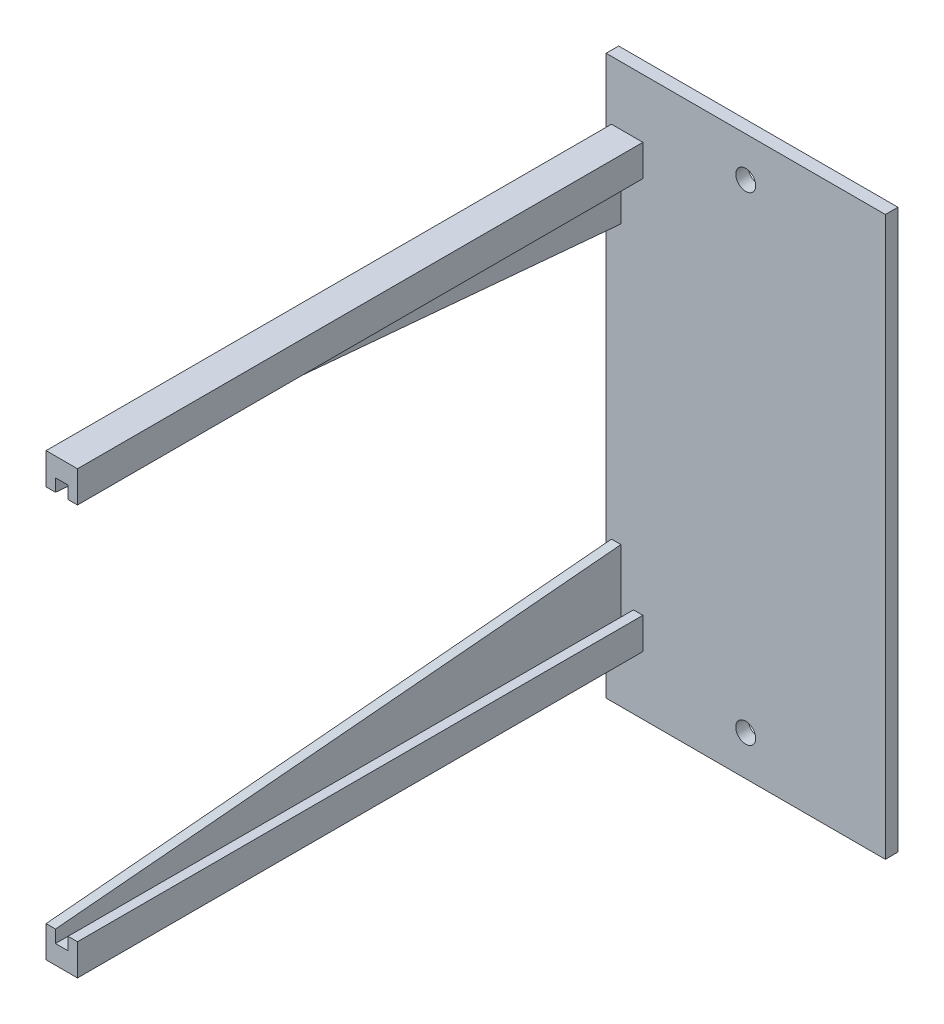
ISO-10303-21;
HEADER;
FILE_DESCRIPTION(('STEP AP214'),'2;1');
FILE_NAME('part.step','',(''),(''),'','','');
FILE_SCHEMA(('AUTOMOTIVE_DESIGN { 1 0 10303 214 1 1 1 1 }'));
ENDSEC;
DATA;
#1=APPLICATION_CONTEXT('core data for automotive mechanical design processes');
#2=APPLICATION_PROTOCOL_DEFINITION('international standard','automotive_design',2000,#1);
#3=PRODUCT_CONTEXT('',#1,'mechanical');
#4=PRODUCT('Part','Part','',(#3));
#5=PRODUCT_RELATED_PRODUCT_CATEGORY('part','',(#4));
#6=PRODUCT_DEFINITION_FORMATION('','',#4);
#7=PRODUCT_DEFINITION_CONTEXT('part definition',#1,'design');
#8=PRODUCT_DEFINITION('design','',#6,#7);
#9=PRODUCT_DEFINITION_SHAPE('','',#8);
#10=(LENGTH_UNIT() NAMED_UNIT(*) SI_UNIT(.MILLI.,.METRE.));
#11=(NAMED_UNIT(*) PLANE_ANGLE_UNIT() SI_UNIT($,.RADIAN.));
#12=(NAMED_UNIT(*) SI_UNIT($,.STERADIAN.) SOLID_ANGLE_UNIT());
#13=UNCERTAINTY_MEASURE_WITH_UNIT(LENGTH_MEASURE(1.E-05),#10,'distance_accuracy_value','');
#14=(GEOMETRIC_REPRESENTATION_CONTEXT(3) GLOBAL_UNCERTAINTY_ASSIGNED_CONTEXT((#13)) GLOBAL_UNIT_ASSIGNED_CONTEXT((#10,
#11,#12)) REPRESENTATION_CONTEXT('',''));
#15=CARTESIAN_POINT('',(0.,0.,0.));
#16=DIRECTION('',(0.,0.,1.));
#17=DIRECTION('',(1.,0.,0.));
#18=AXIS2_PLACEMENT_3D('',#15,#16,#17);
#19=CARTESIAN_POINT('',(-16.3683166717665,-30.1,2.));
#20=DIRECTION('',(0.,-1.,0.));
#21=DIRECTION('',(1.,0.,0.));
#22=AXIS2_PLACEMENT_3D('',#19,#20,#21);
#23=PLANE('',#22);
#24=DIRECTION('',(0.,0.,-1.));
#25=VECTOR('',#24,1.);
#26=CARTESIAN_POINT('',(-17.8683166717665,-30.1,92.));
#27=LINE('',#26,#25);
#28=CARTESIAN_POINT('',(-17.8683166717665,-30.1,92.));
#29=VERTEX_POINT('',#28);
#30=CARTESIAN_POINT('',(-17.8683166717665,-30.1,2.));
#31=VERTEX_POINT('',#30);
#32=EDGE_CURVE('E226',#29,#31,#27,.T.);
#33=ORIENTED_EDGE('',*,*,#32,.F.);
#34=DIRECTION('',(-1.,0.,0.));
#35=VECTOR('',#34,1.);
#36=CARTESIAN_POINT('',(-16.3683166717665,-30.1,92.));
#37=LINE('',#36,#35);
#38=CARTESIAN_POINT('',(-16.3683166717665,-30.1,92.));
#39=VERTEX_POINT('',#38);
#40=EDGE_CURVE('E260',#39,#29,#37,.T.);
#41=ORIENTED_EDGE('',*,*,#40,.F.);
#42=DIRECTION('',(0.,0.,1.));
#43=VECTOR('',#42,1.);
#44=CARTESIAN_POINT('',(-16.3683166717665,-30.1,2.));
#45=LINE('',#44,#43);
#46=CARTESIAN_POINT('',(-16.3683166717665,-30.1,2.));
#47=VERTEX_POINT('',#46);
#48=EDGE_CURVE('E248',#47,#39,#45,.T.);
#49=ORIENTED_EDGE('',*,*,#48,.F.);
#50=DIRECTION('',(-1.,0.,0.));
#51=VECTOR('',#50,1.);
#52=CARTESIAN_POINT('',(-16.3683166717665,-30.1,2.));
#53=LINE('',#52,#51);
#54=EDGE_CURVE('E257',#47,#31,#53,.T.);
#55=ORIENTED_EDGE('',*,*,#54,.T.);
#56=EDGE_LOOP('',(#33,#41,#49,#55));
#57=FACE_BOUND('',#56,.T.);
#58=ADVANCED_FACE('F65',(#57),#23,.F.);
#59=CARTESIAN_POINT('',(0.,0.,2.));
#60=DIRECTION('',(0.,0.,1.));
#61=DIRECTION('',(1.,0.,0.));
#62=AXIS2_PLACEMENT_3D('',#59,#60,#61);
#63=PLANE('',#62);
#64=DIRECTION('',(0.,1.,0.));
#65=VECTOR('',#64,1.);
#66=CARTESIAN_POINT('',(-21.3683166717665,-35.1,2.));
#67=LINE('',#66,#65);
#68=CARTESIAN_POINT('',(-21.3683166717665,-35.1,2.));
#69=VERTEX_POINT('',#68);
#70=CARTESIAN_POINT('',(-21.3683166717665,-22.1000000000848,2.));
#71=VERTEX_POINT('',#70);
#72=EDGE_CURVE('E80',#69,#71,#67,.T.);
#73=ORIENTED_EDGE('',*,*,#72,.T.);
#74=DIRECTION('',(1.,0.,0.));
#75=VECTOR('',#74,1.);
#76=CARTESIAN_POINT('',(-111.723172656276,-22.1000000000799,2.00000000002535));
#77=LINE('',#76,#75);
#78=CARTESIAN_POINT('',(-19.8683166717665,-22.1000000000848,2.));
#79=VERTEX_POINT('',#78);
#80=EDGE_CURVE('E657',#71,#79,#77,.T.);
#81=ORIENTED_EDGE('',*,*,#80,.T.);
#82=DIRECTION('',(0.,1.,0.));
#83=VECTOR('',#82,1.);
#84=CARTESIAN_POINT('',(-19.8683166717665,-32.1,2.));
#85=LINE('',#84,#83);
#86=CARTESIAN_POINT('',(-19.8683166717665,-32.1,2.));
#87=VERTEX_POINT('',#86);
#88=EDGE_CURVE('E88',#87,#79,#85,.T.);
#89=ORIENTED_EDGE('',*,*,#88,.F.);
#90=DIRECTION('',(1.,0.,0.));
#91=VECTOR('',#90,1.);
#92=CARTESIAN_POINT('',(-19.8683166717665,-32.1,2.));
#93=LINE('',#92,#91);
#94=CARTESIAN_POINT('',(-17.8683166717665,-32.1,2.));
#95=VERTEX_POINT('',#94);
#96=EDGE_CURVE('E210',#87,#95,#93,.T.);
#97=ORIENTED_EDGE('',*,*,#96,.T.);
#98=DIRECTION('',(0.,1.,0.));
#99=VECTOR('',#98,1.);
#100=CARTESIAN_POINT('',(-17.8683166717665,-32.1,2.));
#101=LINE('',#100,#99);
#102=EDGE_CURVE('E220',#95,#31,#101,.T.);
#103=ORIENTED_EDGE('',*,*,#102,.T.);
#104=ORIENTED_EDGE('',*,*,#54,.F.);
#105=DIRECTION('',(0.,1.,0.));
#106=VECTOR('',#105,1.);
#107=CARTESIAN_POINT('',(-16.3683166717665,-35.1,2.));
#108=LINE('',#107,#106);
#109=CARTESIAN_POINT('',(-16.3683166717665,-35.1,2.));
#110=VERTEX_POINT('',#109);
#111=EDGE_CURVE('E250',#110,#47,#108,.T.);
#112=ORIENTED_EDGE('',*,*,#111,.F.);
#113=DIRECTION('',(-1.,0.,0.));
#114=VECTOR('',#113,1.);
#115=CARTESIAN_POINT('',(-16.3683166717665,-35.1,2.));
#116=LINE('',#115,#114);
#117=EDGE_CURVE('E254',#110,#69,#116,.T.);
#118=ORIENTED_EDGE('',*,*,#117,.T.);
#119=EDGE_LOOP('',(#73,#81,#89,#97,#103,#104,#112,#118));
#120=FACE_BOUND('',#119,.T.);
#121=CARTESIAN_POINT('',(0.,38.1,2.));
#122=DIRECTION('',(0.,0.,1.));
#123=DIRECTION('',(1.,0.,0.));
#124=AXIS2_PLACEMENT_3D('',#121,#122,#123);
#125=CIRCLE('',#124,1.5875);
#126=CARTESIAN_POINT('',(1.58750000000001,38.1,2.));
#127=VERTEX_POINT('',#126);
#128=EDGE_CURVE('E332',#127,#127,#125,.T.);
#129=ORIENTED_EDGE('',*,*,#128,.F.);
#130=EDGE_LOOP('',(#129));
#131=FACE_BOUND('',#130,.T.);
#132=DIRECTION('',(0.,-1.,0.));
#133=VECTOR('',#132,1.);
#134=CARTESIAN_POINT('',(-22.225,44.45,2.));
#135=LINE('',#134,#133);
#136=CARTESIAN_POINT('',(-22.225,44.45,2.));
#137=VERTEX_POINT('',#136);
#138=CARTESIAN_POINT('',(-22.225,-44.45,2.));
#139=VERTEX_POINT('',#138);
#140=EDGE_CURVE('E338',#137,#139,#135,.T.);
#141=ORIENTED_EDGE('',*,*,#140,.T.);
#142=DIRECTION('',(1.,0.,0.));
#143=VECTOR('',#142,1.);
#144=CARTESIAN_POINT('',(-22.225,-44.45,2.));
#145=LINE('',#144,#143);
#146=CARTESIAN_POINT('',(22.225,-44.45,2.));
#147=VERTEX_POINT('',#146);
#148=EDGE_CURVE('E341',#139,#147,#145,.T.);
#149=ORIENTED_EDGE('',*,*,#148,.T.);
#150=DIRECTION('',(0.,-1.,0.));
#151=VECTOR('',#150,1.);
#152=CARTESIAN_POINT('',(22.225,44.45,2.));
#153=LINE('',#152,#151);
#154=CARTESIAN_POINT('',(22.225,44.45,2.));
#155=VERTEX_POINT('',#154);
#156=EDGE_CURVE('E344',#155,#147,#153,.T.);
#157=ORIENTED_EDGE('',*,*,#156,.F.);
#158=DIRECTION('',(1.,0.,0.));
#159=VECTOR('',#158,1.);
#160=CARTESIAN_POINT('',(-22.225,44.45,2.));
#161=LINE('',#160,#159);
#162=EDGE_CURVE('E347',#137,#155,#161,.T.);
#163=ORIENTED_EDGE('',*,*,#162,.F.);
#164=EDGE_LOOP('',(#141,#149,#157,#163));
#165=FACE_BOUND('',#164,.T.);
#166=CARTESIAN_POINT('',(0.,-38.1,2.));
#167=DIRECTION('',(0.,0.,1.));
#168=DIRECTION('',(1.,0.,0.));
#169=AXIS2_PLACEMENT_3D('',#166,#167,#168);
#170=CIRCLE('',#169,1.5875);
#171=CARTESIAN_POINT('',(1.58750000000001,-38.1,2.));
#172=VERTEX_POINT('',#171);
#173=EDGE_CURVE('E326',#172,#172,#170,.T.);
#174=ORIENTED_EDGE('',*,*,#173,.F.);
#175=EDGE_LOOP('',(#174));
#176=FACE_BOUND('',#175,.T.);
#177=DIRECTION('',(0.,-1.,0.));
#178=VECTOR('',#177,1.);
#179=CARTESIAN_POINT('',(-19.8683166717665,32.1,2.));
#180=LINE('',#179,#178);
#181=CARTESIAN_POINT('',(-19.8683166717665,32.1,2.));
#182=VERTEX_POINT('',#181);
#183=CARTESIAN_POINT('',(-19.8683166717665,22.1000000000231,1.99999999999374));
#184=VERTEX_POINT('',#183);
#185=EDGE_CURVE('E269',#182,#184,#180,.T.);
#186=ORIENTED_EDGE('',*,*,#185,.T.);
#187=DIRECTION('',(1.,0.,0.));
#188=VECTOR('',#187,1.);
#189=CARTESIAN_POINT('',(-111.723172656256,22.1000000000231,1.99999999999374));
#190=LINE('',#189,#188);
#191=CARTESIAN_POINT('',(-21.3683166717665,22.1000000000231,1.99999999999374));
#192=VERTEX_POINT('',#191);
#193=EDGE_CURVE('E256',#192,#184,#190,.T.);
#194=ORIENTED_EDGE('',*,*,#193,.F.);
#195=DIRECTION('',(0.,-1.,0.));
#196=VECTOR('',#195,1.);
#197=CARTESIAN_POINT('',(-21.3683166717665,35.1,2.));
#198=LINE('',#197,#196);
#199=CARTESIAN_POINT('',(-21.3683166717665,35.1,2.));
#200=VERTEX_POINT('',#199);
#201=EDGE_CURVE('E297',#200,#192,#198,.T.);
#202=ORIENTED_EDGE('',*,*,#201,.F.);
#203=DIRECTION('',(-1.,0.,0.));
#204=VECTOR('',#203,1.);
#205=CARTESIAN_POINT('',(-16.3683166717665,35.1,2.));
#206=LINE('',#205,#204);
#207=CARTESIAN_POINT('',(-16.3683166717665,35.1,2.));
#208=VERTEX_POINT('',#207);
#209=EDGE_CURVE('E313',#208,#200,#206,.T.);
#210=ORIENTED_EDGE('',*,*,#209,.F.);
#211=DIRECTION('',(0.,-1.,0.));
#212=VECTOR('',#211,1.);
#213=CARTESIAN_POINT('',(-16.3683166717665,35.1,2.));
#214=LINE('',#213,#212);
#215=CARTESIAN_POINT('',(-16.3683166717665,30.1,2.));
#216=VERTEX_POINT('',#215);
#217=EDGE_CURVE('E305',#208,#216,#214,.T.);
#218=ORIENTED_EDGE('',*,*,#217,.T.);
#219=DIRECTION('',(-1.,0.,0.));
#220=VECTOR('',#219,1.);
#221=CARTESIAN_POINT('',(-16.3683166717665,30.1,2.));
#222=LINE('',#221,#220);
#223=CARTESIAN_POINT('',(-17.8683166717665,30.1,2.));
#224=VERTEX_POINT('',#223);
#225=EDGE_CURVE('E321',#216,#224,#222,.T.);
#226=ORIENTED_EDGE('',*,*,#225,.T.);
#227=DIRECTION('',(0.,-1.,0.));
#228=VECTOR('',#227,1.);
#229=CARTESIAN_POINT('',(-17.8683166717665,32.1,2.));
#230=LINE('',#229,#228);
#231=CARTESIAN_POINT('',(-17.8683166717665,32.1,2.));
#232=VERTEX_POINT('',#231);
#233=EDGE_CURVE('E284',#232,#224,#230,.T.);
#234=ORIENTED_EDGE('',*,*,#233,.F.);
#235=DIRECTION('',(1.,0.,0.));
#236=VECTOR('',#235,1.);
#237=CARTESIAN_POINT('',(-19.8683166717665,32.1,2.));
#238=LINE('',#237,#236);
#239=EDGE_CURVE('E276',#182,#232,#238,.T.);
#240=ORIENTED_EDGE('',*,*,#239,.F.);
#241=EDGE_LOOP('',(#186,#194,#202,#210,#218,#226,#234,#240));
#242=FACE_BOUND('',#241,.T.);
#243=ADVANCED_FACE('F381',(#120,#131,#165,#176,#242),#63,.T.);
#244=CARTESIAN_POINT('',(-16.3683166717665,30.1,92.));
#245=DIRECTION('',(0.,0.,1.));
#246=DIRECTION('',(1.,0.,0.));
#247=AXIS2_PLACEMENT_3D('',#244,#245,#246);
#248=PLANE('',#247);
#249=DIRECTION('',(-1.,0.,0.));
#250=VECTOR('',#249,1.);
#251=CARTESIAN_POINT('',(-16.3683166717665,30.1,92.));
#252=LINE('',#251,#250);
#253=CARTESIAN_POINT('',(-19.8683166717665,30.100000000015,91.9999999998709));
#254=VERTEX_POINT('',#253);
#255=CARTESIAN_POINT('',(-21.3683166717665,30.100000000015,91.9999999998709));
#256=VERTEX_POINT('',#255);
#257=EDGE_CURVE('E320',#254,#256,#252,.T.);
#258=ORIENTED_EDGE('',*,*,#257,.F.);
#259=DIRECTION('',(0.,-1.,0.));
#260=VECTOR('',#259,1.);
#261=CARTESIAN_POINT('',(-19.8683166717665,32.1,92.));
#262=LINE('',#261,#260);
#263=CARTESIAN_POINT('',(-19.8683166717665,32.1,92.));
#264=VERTEX_POINT('',#263);
#265=EDGE_CURVE('E272',#264,#254,#262,.T.);
#266=ORIENTED_EDGE('',*,*,#265,.F.);
#267=DIRECTION('',(1.,0.,0.));
#268=VECTOR('',#267,1.);
#269=CARTESIAN_POINT('',(-19.8683166717665,32.1,92.));
#270=LINE('',#269,#268);
#271=CARTESIAN_POINT('',(-17.8683166717665,32.1,92.));
#272=VERTEX_POINT('',#271);
#273=EDGE_CURVE('E279',#264,#272,#270,.T.);
#274=ORIENTED_EDGE('',*,*,#273,.T.);
#275=DIRECTION('',(0.,-1.,0.));
#276=VECTOR('',#275,1.);
#277=CARTESIAN_POINT('',(-17.8683166717665,32.1,92.));
#278=LINE('',#277,#276);
#279=CARTESIAN_POINT('',(-17.8683166717665,30.1,92.));
#280=VERTEX_POINT('',#279);
#281=EDGE_CURVE('E275',#272,#280,#278,.T.);
#282=ORIENTED_EDGE('',*,*,#281,.T.);
#283=CARTESIAN_POINT('',(-16.3683166717665,30.1,92.));
#284=VERTEX_POINT('',#283);
#285=EDGE_CURVE('E317',#284,#280,#252,.T.);
#286=ORIENTED_EDGE('',*,*,#285,.F.);
#287=DIRECTION('',(0.,1.,0.));
#288=VECTOR('',#287,1.);
#289=CARTESIAN_POINT('',(-16.3683166717665,30.1,92.));
#290=LINE('',#289,#288);
#291=CARTESIAN_POINT('',(-16.3683166717665,35.1,92.));
#292=VERTEX_POINT('',#291);
#293=EDGE_CURVE('E310',#284,#292,#290,.T.);
#294=ORIENTED_EDGE('',*,*,#293,.T.);
#295=DIRECTION('',(-1.,0.,0.));
#296=VECTOR('',#295,1.);
#297=CARTESIAN_POINT('',(-16.3683166717665,35.1,92.));
#298=LINE('',#297,#296);
#299=CARTESIAN_POINT('',(-21.3683166717665,35.1,92.));
#300=VERTEX_POINT('',#299);
#301=EDGE_CURVE('E314',#292,#300,#298,.T.);
#302=ORIENTED_EDGE('',*,*,#301,.T.);
#303=DIRECTION('',(0.,1.,0.));
#304=VECTOR('',#303,1.);
#305=CARTESIAN_POINT('',(-21.3683166717665,30.1,92.));
#306=LINE('',#305,#304);
#307=EDGE_CURVE('E299',#256,#300,#306,.T.);
#308=ORIENTED_EDGE('',*,*,#307,.F.);
#309=EDGE_LOOP('',(#258,#266,#274,#282,#286,#294,#302,#308));
#310=FACE_BOUND('',#309,.T.);
#311=ADVANCED_FACE('F389',(#310),#248,.T.);
#312=CARTESIAN_POINT('',(0.,0.,0.));
#313=DIRECTION('',(0.,0.,1.));
#314=DIRECTION('',(1.,0.,0.));
#315=AXIS2_PLACEMENT_3D('',#312,#313,#314);
#316=PLANE('',#315);
#317=CARTESIAN_POINT('',(0.,38.1,0.));
#318=DIRECTION('',(0.,0.,1.));
#319=DIRECTION('',(1.,0.,0.));
#320=AXIS2_PLACEMENT_3D('',#317,#318,#319);
#321=CIRCLE('',#320,1.5875);
#322=CARTESIAN_POINT('',(1.58750000000001,38.1,0.));
#323=VERTEX_POINT('',#322);
#324=EDGE_CURVE('E329',#323,#323,#321,.T.);
#325=ORIENTED_EDGE('',*,*,#324,.T.);
#326=EDGE_LOOP('',(#325));
#327=FACE_BOUND('',#326,.T.);
#328=DIRECTION('',(0.,-1.,0.));
#329=VECTOR('',#328,1.);
#330=CARTESIAN_POINT('',(-22.225,44.45,0.));
#331=LINE('',#330,#329);
#332=CARTESIAN_POINT('',(-22.225,44.45,0.));
#333=VERTEX_POINT('',#332);
#334=CARTESIAN_POINT('',(-22.225,-44.45,0.));
#335=VERTEX_POINT('',#334);
#336=EDGE_CURVE('E335',#333,#335,#331,.T.);
#337=ORIENTED_EDGE('',*,*,#336,.F.);
#338=DIRECTION('',(1.,0.,0.));
#339=VECTOR('',#338,1.);
#340=CARTESIAN_POINT('',(-22.225,44.45,0.));
#341=LINE('',#340,#339);
#342=CARTESIAN_POINT('',(22.225,44.45,0.));
#343=VERTEX_POINT('',#342);
#344=EDGE_CURVE('E342',#333,#343,#341,.T.);
#345=ORIENTED_EDGE('',*,*,#344,.T.);
#346=DIRECTION('',(0.,-1.,0.));
#347=VECTOR('',#346,1.);
#348=CARTESIAN_POINT('',(22.225,44.45,0.));
#349=LINE('',#348,#347);
#350=CARTESIAN_POINT('',(22.225,-44.45,0.));
#351=VERTEX_POINT('',#350);
#352=EDGE_CURVE('E356',#343,#351,#349,.T.);
#353=ORIENTED_EDGE('',*,*,#352,.T.);
#354=DIRECTION('',(1.,0.,0.));
#355=VECTOR('',#354,1.);
#356=CARTESIAN_POINT('',(-22.225,-44.45,0.));
#357=LINE('',#356,#355);
#358=EDGE_CURVE('E353',#335,#351,#357,.T.);
#359=ORIENTED_EDGE('',*,*,#358,.F.);
#360=EDGE_LOOP('',(#337,#345,#353,#359));
#361=FACE_BOUND('',#360,.T.);
#362=CARTESIAN_POINT('',(0.,-38.1,0.));
#363=DIRECTION('',(0.,0.,1.));
#364=DIRECTION('',(1.,0.,0.));
#365=AXIS2_PLACEMENT_3D('',#362,#363,#364);
#366=CIRCLE('',#365,1.5875);
#367=CARTESIAN_POINT('',(1.58750000000001,-38.1,0.));
#368=VERTEX_POINT('',#367);
#369=EDGE_CURVE('E316',#368,#368,#366,.T.);
#370=ORIENTED_EDGE('',*,*,#369,.T.);
#371=EDGE_LOOP('',(#370));
#372=FACE_BOUND('',#371,.T.);
#373=ADVANCED_FACE('F373',(#327,#361,#372),#316,.F.);
#374=CARTESIAN_POINT('',(-22.225,44.45,2.));
#375=DIRECTION('',(1.,0.,0.));
#376=DIRECTION('',(0.,0.,-1.));
#377=AXIS2_PLACEMENT_3D('',#374,#375,#376);
#378=PLANE('',#377);
#379=ORIENTED_EDGE('',*,*,#336,.T.);
#380=DIRECTION('',(0.,0.,-1.));
#381=VECTOR('',#380,1.);
#382=CARTESIAN_POINT('',(-22.225,-44.45,2.));
#383=LINE('',#382,#381);
#384=EDGE_CURVE('E12',#139,#335,#383,.T.);
#385=ORIENTED_EDGE('',*,*,#384,.F.);
#386=ORIENTED_EDGE('',*,*,#140,.F.);
#387=DIRECTION('',(0.,0.,-1.));
#388=VECTOR('',#387,1.);
#389=CARTESIAN_POINT('',(-22.225,44.45,2.));
#390=LINE('',#389,#388);
#391=EDGE_CURVE('E350',#137,#333,#390,.T.);
#392=ORIENTED_EDGE('',*,*,#391,.T.);
#393=EDGE_LOOP('',(#379,#385,#386,#392));
#394=FACE_BOUND('',#393,.T.);
#395=ADVANCED_FACE('F67',(#394),#378,.F.);
#396=CARTESIAN_POINT('',(-22.225,-44.45,2.));
#397=DIRECTION('',(0.,1.,0.));
#398=DIRECTION('',(0.,0.,1.));
#399=AXIS2_PLACEMENT_3D('',#396,#397,#398);
#400=PLANE('',#399);
#401=ORIENTED_EDGE('',*,*,#358,.T.);
#402=DIRECTION('',(0.,0.,-1.));
#403=VECTOR('',#402,1.);
#404=CARTESIAN_POINT('',(22.225,-44.45,2.));
#405=LINE('',#404,#403);
#406=EDGE_CURVE('E73',#147,#351,#405,.T.);
#407=ORIENTED_EDGE('',*,*,#406,.F.);
#408=ORIENTED_EDGE('',*,*,#148,.F.);
#409=ORIENTED_EDGE('',*,*,#384,.T.);
#410=EDGE_LOOP('',(#401,#407,#408,#409));
#411=FACE_BOUND('',#410,.T.);
#412=ADVANCED_FACE('F369',(#411),#400,.F.);
#413=CARTESIAN_POINT('',(22.225,44.45,2.));
#414=DIRECTION('',(1.,0.,0.));
#415=DIRECTION('',(0.,0.,-1.));
#416=AXIS2_PLACEMENT_3D('',#413,#414,#415);
#417=PLANE('',#416);
#418=ORIENTED_EDGE('',*,*,#352,.F.);
#419=DIRECTION('',(0.,0.,-1.));
#420=VECTOR('',#419,1.);
#421=CARTESIAN_POINT('',(22.225,44.45,2.));
#422=LINE('',#421,#420);
#423=EDGE_CURVE('E362',#155,#343,#422,.T.);
#424=ORIENTED_EDGE('',*,*,#423,.F.);
#425=ORIENTED_EDGE('',*,*,#156,.T.);
#426=ORIENTED_EDGE('',*,*,#406,.T.);
#427=EDGE_LOOP('',(#418,#424,#425,#426));
#428=FACE_BOUND('',#427,.T.);
#429=ADVANCED_FACE('F366',(#428),#417,.T.);
#430=CARTESIAN_POINT('',(-22.225,44.45,2.));
#431=DIRECTION('',(0.,1.,0.));
#432=DIRECTION('',(0.,0.,1.));
#433=AXIS2_PLACEMENT_3D('',#430,#431,#432);
#434=PLANE('',#433);
#435=ORIENTED_EDGE('',*,*,#344,.F.);
#436=ORIENTED_EDGE('',*,*,#391,.F.);
#437=ORIENTED_EDGE('',*,*,#162,.T.);
#438=ORIENTED_EDGE('',*,*,#423,.T.);
#439=EDGE_LOOP('',(#435,#436,#437,#438));
#440=FACE_BOUND('',#439,.T.);
#441=ADVANCED_FACE('F377',(#440),#434,.T.);
#442=CARTESIAN_POINT('',(0.,38.1,2.));
#443=DIRECTION('',(0.,0.,-1.));
#444=DIRECTION('',(-1.,0.,0.));
#445=AXIS2_PLACEMENT_3D('',#442,#443,#444);
#446=CYLINDRICAL_SURFACE('',#445,1.5875);
#447=ORIENTED_EDGE('',*,*,#128,.T.);
#448=EDGE_LOOP('',(#447));
#449=FACE_BOUND('',#448,.T.);
#450=ORIENTED_EDGE('',*,*,#324,.F.);
#451=EDGE_LOOP('',(#450));
#452=FACE_BOUND('',#451,.T.);
#453=ADVANCED_FACE('F448',(#449,#452),#446,.F.);
#454=CARTESIAN_POINT('',(0.,-38.1,2.));
#455=DIRECTION('',(0.,0.,-1.));
#456=DIRECTION('',(-1.,0.,0.));
#457=AXIS2_PLACEMENT_3D('',#454,#455,#456);
#458=CYLINDRICAL_SURFACE('',#457,1.5875);
#459=ORIENTED_EDGE('',*,*,#173,.T.);
#460=EDGE_LOOP('',(#459));
#461=FACE_BOUND('',#460,.T.);
#462=ORIENTED_EDGE('',*,*,#369,.F.);
#463=EDGE_LOOP('',(#462));
#464=FACE_BOUND('',#463,.T.);
#465=ADVANCED_FACE('F444',(#461,#464),#458,.F.);
#466=CARTESIAN_POINT('',(-16.3683166717665,35.1,92.));
#467=DIRECTION('',(0.,1.,0.));
#468=DIRECTION('',(-1.,0.,0.));
#469=AXIS2_PLACEMENT_3D('',#466,#467,#468);
#470=PLANE('',#469);
#471=ORIENTED_EDGE('',*,*,#209,.T.);
#472=DIRECTION('',(0.,0.,-1.));
#473=VECTOR('',#472,1.);
#474=CARTESIAN_POINT('',(-21.3683166717665,35.1,92.));
#475=LINE('',#474,#473);
#476=EDGE_CURVE('E294',#300,#200,#475,.T.);
#477=ORIENTED_EDGE('',*,*,#476,.F.);
#478=ORIENTED_EDGE('',*,*,#301,.F.);
#479=DIRECTION('',(0.,0.,-1.));
#480=VECTOR('',#479,1.);
#481=CARTESIAN_POINT('',(-16.3683166717665,35.1,92.));
#482=LINE('',#481,#480);
#483=EDGE_CURVE('E302',#292,#208,#482,.T.);
#484=ORIENTED_EDGE('',*,*,#483,.T.);
#485=EDGE_LOOP('',(#471,#477,#478,#484));
#486=FACE_BOUND('',#485,.T.);
#487=ADVANCED_FACE('F440',(#486),#470,.T.);
#488=CARTESIAN_POINT('',(-16.3683166717665,30.1,2.));
#489=DIRECTION('',(0.,-1.,0.));
#490=DIRECTION('',(1.,0.,0.));
#491=AXIS2_PLACEMENT_3D('',#488,#489,#490);
#492=PLANE('',#491);
#493=DIRECTION('',(0.,0.,-1.));
#494=VECTOR('',#493,1.);
#495=CARTESIAN_POINT('',(-17.8683166717665,30.1,92.));
#496=LINE('',#495,#494);
#497=EDGE_CURVE('E291',#280,#224,#496,.T.);
#498=ORIENTED_EDGE('',*,*,#497,.T.);
#499=ORIENTED_EDGE('',*,*,#225,.F.);
#500=DIRECTION('',(0.,0.,1.));
#501=VECTOR('',#500,1.);
#502=CARTESIAN_POINT('',(-16.3683166717665,30.1,2.));
#503=LINE('',#502,#501);
#504=EDGE_CURVE('E307',#216,#284,#503,.T.);
#505=ORIENTED_EDGE('',*,*,#504,.T.);
#506=ORIENTED_EDGE('',*,*,#285,.T.);
#507=EDGE_LOOP('',(#498,#499,#505,#506));
#508=FACE_BOUND('',#507,.T.);
#509=ADVANCED_FACE('F433',(#508),#492,.T.);
#510=CARTESIAN_POINT('',(-16.3683166717665,0.,0.));
#511=DIRECTION('',(-1.,0.,0.));
#512=DIRECTION('',(0.,0.,1.));
#513=AXIS2_PLACEMENT_3D('',#510,#511,#512);
#514=PLANE('',#513);
#515=ORIENTED_EDGE('',*,*,#483,.F.);
#516=ORIENTED_EDGE('',*,*,#293,.F.);
#517=ORIENTED_EDGE('',*,*,#504,.F.);
#518=ORIENTED_EDGE('',*,*,#217,.F.);
#519=EDGE_LOOP('',(#515,#516,#517,#518));
#520=FACE_BOUND('',#519,.T.);
#521=ADVANCED_FACE('F429',(#520),#514,.F.);
#522=CARTESIAN_POINT('',(-21.3683166717665,0.,0.));
#523=DIRECTION('',(-1.,0.,0.));
#524=DIRECTION('',(0.,0.,1.));
#525=AXIS2_PLACEMENT_3D('',#522,#523,#524);
#526=PLANE('',#525);
#527=ORIENTED_EDGE('',*,*,#476,.T.);
#528=ORIENTED_EDGE('',*,*,#201,.T.);
#529=DIRECTION('',(0.,0.0885397902837945,0.996072640692687));
#530=VECTOR('',#529,1.);
#531=CARTESIAN_POINT('',(-21.3683166717665,33017.0416952475,371195.094071534));
#532=LINE('',#531,#530);
#533=EDGE_CURVE('E266',#192,#256,#532,.T.);
#534=ORIENTED_EDGE('',*,*,#533,.T.);
#535=ORIENTED_EDGE('',*,*,#307,.T.);
#536=EDGE_LOOP('',(#527,#528,#534,#535));
#537=FACE_BOUND('',#536,.T.);
#538=ADVANCED_FACE('F425',(#537),#526,.T.);
#539=CARTESIAN_POINT('',(-19.8683166717665,32.1,92.));
#540=DIRECTION('',(1.,0.,0.));
#541=DIRECTION('',(0.,0.,-1.));
#542=AXIS2_PLACEMENT_3D('',#539,#540,#541);
#543=PLANE('',#542);
#544=ORIENTED_EDGE('',*,*,#185,.F.);
#545=DIRECTION('',(0.,0.,-1.));
#546=VECTOR('',#545,1.);
#547=CARTESIAN_POINT('',(-19.8683166717665,32.1,92.));
#548=LINE('',#547,#546);
#549=EDGE_CURVE('E282',#264,#182,#548,.T.);
#550=ORIENTED_EDGE('',*,*,#549,.F.);
#551=ORIENTED_EDGE('',*,*,#265,.T.);
#552=DIRECTION('',(0.,0.0885397902837945,0.996072640692687));
#553=VECTOR('',#552,1.);
#554=CARTESIAN_POINT('',(-19.8683166717665,33017.0416952475,371195.094071534));
#555=LINE('',#554,#553);
#556=EDGE_CURVE('E264',#184,#254,#555,.T.);
#557=ORIENTED_EDGE('',*,*,#556,.F.);
#558=EDGE_LOOP('',(#544,#550,#551,#557));
#559=FACE_BOUND('',#558,.T.);
#560=ADVANCED_FACE('F421',(#559),#543,.T.);
#561=CARTESIAN_POINT('',(-17.8683166717665,32.1,92.));
#562=DIRECTION('',(1.,0.,0.));
#563=DIRECTION('',(0.,1.,0.));
#564=AXIS2_PLACEMENT_3D('',#561,#562,#563);
#565=PLANE('',#564);
#566=ORIENTED_EDGE('',*,*,#233,.T.);
#567=ORIENTED_EDGE('',*,*,#497,.F.);
#568=ORIENTED_EDGE('',*,*,#281,.F.);
#569=DIRECTION('',(0.,0.,-1.));
#570=VECTOR('',#569,1.);
#571=CARTESIAN_POINT('',(-17.8683166717665,32.1,92.));
#572=LINE('',#571,#570);
#573=EDGE_CURVE('E289',#272,#232,#572,.T.);
#574=ORIENTED_EDGE('',*,*,#573,.T.);
#575=EDGE_LOOP('',(#566,#567,#568,#574));
#576=FACE_BOUND('',#575,.T.);
#577=ADVANCED_FACE('F417',(#576),#565,.F.);
#578=CARTESIAN_POINT('',(-19.8683166717665,32.1,92.));
#579=DIRECTION('',(0.,1.,0.));
#580=DIRECTION('',(0.,0.,1.));
#581=AXIS2_PLACEMENT_3D('',#578,#579,#580);
#582=PLANE('',#581);
#583=ORIENTED_EDGE('',*,*,#239,.T.);
#584=ORIENTED_EDGE('',*,*,#573,.F.);
#585=ORIENTED_EDGE('',*,*,#273,.F.);
#586=ORIENTED_EDGE('',*,*,#549,.T.);
#587=EDGE_LOOP('',(#583,#584,#585,#586));
#588=FACE_BOUND('',#587,.T.);
#589=ADVANCED_FACE('F413',(#588),#582,.F.);
#590=CARTESIAN_POINT('',(-111.723172656256,33017.0416952475,371195.094071534));
#591=DIRECTION('',(0.,0.996072640692686,-0.0885397902837945));
#592=DIRECTION('',(0.,0.0885397902837945,0.996072640692687));
#593=AXIS2_PLACEMENT_3D('',#590,#591,#592);
#594=PLANE('',#593);
#595=ORIENTED_EDGE('',*,*,#533,.F.);
#596=ORIENTED_EDGE('',*,*,#193,.T.);
#597=ORIENTED_EDGE('',*,*,#556,.T.);
#598=ORIENTED_EDGE('',*,*,#257,.T.);
#599=EDGE_LOOP('',(#595,#596,#597,#598));
#600=FACE_BOUND('',#599,.T.);
#601=ADVANCED_FACE('F409',(#600),#594,.F.);
#602=CARTESIAN_POINT('',(-16.3683166717665,-35.1,92.));
#603=DIRECTION('',(0.,1.,0.));
#604=DIRECTION('',(-1.,0.,0.));
#605=AXIS2_PLACEMENT_3D('',#602,#603,#604);
#606=PLANE('',#605);
#607=DIRECTION('',(-1.,0.,0.));
#608=VECTOR('',#607,1.);
#609=CARTESIAN_POINT('',(-16.3683166717665,-35.1,92.));
#610=LINE('',#609,#608);
#611=CARTESIAN_POINT('',(-16.3683166717665,-35.1,92.));
#612=VERTEX_POINT('',#611);
#613=CARTESIAN_POINT('',(-21.3683166717665,-35.1,92.));
#614=VERTEX_POINT('',#613);
#615=EDGE_CURVE('E253',#612,#614,#610,.T.);
#616=ORIENTED_EDGE('',*,*,#615,.T.);
#617=DIRECTION('',(0.,0.,-1.));
#618=VECTOR('',#617,1.);
#619=CARTESIAN_POINT('',(-21.3683166717665,-35.1,92.));
#620=LINE('',#619,#618);
#621=EDGE_CURVE('E211',#614,#69,#620,.T.);
#622=ORIENTED_EDGE('',*,*,#621,.T.);
#623=ORIENTED_EDGE('',*,*,#117,.F.);
#624=DIRECTION('',(0.,0.,-1.));
#625=VECTOR('',#624,1.);
#626=CARTESIAN_POINT('',(-16.3683166717665,-35.1,92.));
#627=LINE('',#626,#625);
#628=EDGE_CURVE('E243',#612,#110,#627,.T.);
#629=ORIENTED_EDGE('',*,*,#628,.F.);
#630=EDGE_LOOP('',(#616,#622,#623,#629));
#631=FACE_BOUND('',#630,.T.);
#632=ADVANCED_FACE('F406',(#631),#606,.F.);
#633=CARTESIAN_POINT('',(-16.3683166717665,-30.1,92.));
#634=DIRECTION('',(0.,0.,-1.));
#635=DIRECTION('',(-1.,0.,0.));
#636=AXIS2_PLACEMENT_3D('',#633,#634,#635);
#637=PLANE('',#636);
#638=DIRECTION('',(1.,0.,0.));
#639=VECTOR('',#638,1.);
#640=CARTESIAN_POINT('',(-19.8683166717665,-32.1,92.));
#641=LINE('',#640,#639);
#642=CARTESIAN_POINT('',(-19.8683166717665,-32.1,92.));
#643=VERTEX_POINT('',#642);
#644=CARTESIAN_POINT('',(-17.8683166717665,-32.1,92.));
#645=VERTEX_POINT('',#644);
#646=EDGE_CURVE('E208',#643,#645,#641,.T.);
#647=ORIENTED_EDGE('',*,*,#646,.F.);
#648=DIRECTION('',(0.,1.,0.));
#649=VECTOR('',#648,1.);
#650=CARTESIAN_POINT('',(-19.8683166717665,-32.1,92.));
#651=LINE('',#650,#649);
#652=CARTESIAN_POINT('',(-19.8683166717665,-30.1,92.));
#653=VERTEX_POINT('',#652);
#654=EDGE_CURVE('E214',#643,#653,#651,.T.);
#655=ORIENTED_EDGE('',*,*,#654,.T.);
#656=CARTESIAN_POINT('',(-21.3683166717665,-30.1,92.));
#657=VERTEX_POINT('',#656);
#658=EDGE_CURVE('E262',#653,#657,#37,.T.);
#659=ORIENTED_EDGE('',*,*,#658,.T.);
#660=DIRECTION('',(0.,-1.,0.));
#661=VECTOR('',#660,1.);
#662=CARTESIAN_POINT('',(-21.3683166717665,-30.1,92.));
#663=LINE('',#662,#661);
#664=EDGE_CURVE('E239',#657,#614,#663,.T.);
#665=ORIENTED_EDGE('',*,*,#664,.T.);
#666=ORIENTED_EDGE('',*,*,#615,.F.);
#667=DIRECTION('',(0.,-1.,0.));
#668=VECTOR('',#667,1.);
#669=CARTESIAN_POINT('',(-16.3683166717665,-30.1,92.));
#670=LINE('',#669,#668);
#671=EDGE_CURVE('E246',#39,#612,#670,.T.);
#672=ORIENTED_EDGE('',*,*,#671,.F.);
#673=ORIENTED_EDGE('',*,*,#40,.T.);
#674=DIRECTION('',(0.,1.,0.));
#675=VECTOR('',#674,1.);
#676=CARTESIAN_POINT('',(-17.8683166717665,-32.1,92.));
#677=LINE('',#676,#675);
#678=EDGE_CURVE('E224',#645,#29,#677,.T.);
#679=ORIENTED_EDGE('',*,*,#678,.F.);
#680=EDGE_LOOP('',(#647,#655,#659,#665,#666,#672,#673,#679));
#681=FACE_BOUND('',#680,.T.);
#682=ADVANCED_FACE('F222',(#681),#637,.F.);
#683=CARTESIAN_POINT('',(-16.3683166717665,0.,0.));
#684=DIRECTION('',(-1.,0.,0.));
#685=DIRECTION('',(0.,0.,1.));
#686=AXIS2_PLACEMENT_3D('',#683,#684,#685);
#687=PLANE('',#686);
#688=ORIENTED_EDGE('',*,*,#628,.T.);
#689=ORIENTED_EDGE('',*,*,#111,.T.);
#690=ORIENTED_EDGE('',*,*,#48,.T.);
#691=ORIENTED_EDGE('',*,*,#671,.T.);
#692=EDGE_LOOP('',(#688,#689,#690,#691));
#693=FACE_BOUND('',#692,.T.);
#694=ADVANCED_FACE('F402',(#693),#687,.F.);
#695=CARTESIAN_POINT('',(-21.3683166717665,0.,0.));
#696=DIRECTION('',(-1.,0.,0.));
#697=DIRECTION('',(0.,0.,1.));
#698=AXIS2_PLACEMENT_3D('',#695,#696,#697);
#699=PLANE('',#698);
#700=ORIENTED_EDGE('',*,*,#621,.F.);
#701=ORIENTED_EDGE('',*,*,#664,.F.);
#702=DIRECTION('',(0.,-0.0885397902837945,0.996072640692687));
#703=VECTOR('',#702,1.);
#704=CARTESIAN_POINT('',(-21.3683166717665,-37588.3992650663,422622.866731994));
#705=LINE('',#704,#703);
#706=EDGE_CURVE('E231',#71,#657,#705,.T.);
#707=ORIENTED_EDGE('',*,*,#706,.F.);
#708=ORIENTED_EDGE('',*,*,#72,.F.);
#709=EDGE_LOOP('',(#700,#701,#707,#708));
#710=FACE_BOUND('',#709,.T.);
#711=ADVANCED_FACE('F521',(#710),#699,.T.);
#712=CARTESIAN_POINT('',(-19.8683166717665,-32.1,92.));
#713=DIRECTION('',(-1.,0.,0.));
#714=DIRECTION('',(0.,0.,1.));
#715=AXIS2_PLACEMENT_3D('',#712,#713,#714);
#716=PLANE('',#715);
#717=ORIENTED_EDGE('',*,*,#88,.T.);
#718=DIRECTION('',(0.,-0.0885397902837945,0.996072640692687));
#719=VECTOR('',#718,1.);
#720=CARTESIAN_POINT('',(-19.8683166717665,-37588.3992650663,422622.866731994));
#721=LINE('',#720,#719);
#722=EDGE_CURVE('E217',#79,#653,#721,.T.);
#723=ORIENTED_EDGE('',*,*,#722,.T.);
#724=ORIENTED_EDGE('',*,*,#654,.F.);
#725=DIRECTION('',(0.,0.,-1.));
#726=VECTOR('',#725,1.);
#727=CARTESIAN_POINT('',(-19.8683166717665,-32.1,92.));
#728=LINE('',#727,#726);
#729=EDGE_CURVE('E203',#643,#87,#728,.T.);
#730=ORIENTED_EDGE('',*,*,#729,.T.);
#731=EDGE_LOOP('',(#717,#723,#724,#730));
#732=FACE_BOUND('',#731,.T.);
#733=ADVANCED_FACE('F215',(#732),#716,.F.);
#734=CARTESIAN_POINT('',(-19.8683166717665,-32.1,92.));
#735=DIRECTION('',(0.,1.,0.));
#736=DIRECTION('',(0.,0.,1.));
#737=AXIS2_PLACEMENT_3D('',#734,#735,#736);
#738=PLANE('',#737);
#739=ORIENTED_EDGE('',*,*,#96,.F.);
#740=ORIENTED_EDGE('',*,*,#729,.F.);
#741=ORIENTED_EDGE('',*,*,#646,.T.);
#742=DIRECTION('',(0.,0.,-1.));
#743=VECTOR('',#742,1.);
#744=CARTESIAN_POINT('',(-17.8683166717665,-32.1,92.));
#745=LINE('',#744,#743);
#746=EDGE_CURVE('E212',#645,#95,#745,.T.);
#747=ORIENTED_EDGE('',*,*,#746,.T.);
#748=EDGE_LOOP('',(#739,#740,#741,#747));
#749=FACE_BOUND('',#748,.T.);
#750=ADVANCED_FACE('F205',(#749),#738,.T.);
#751=CARTESIAN_POINT('',(-17.8683166717665,-32.1,92.));
#752=DIRECTION('',(-1.,0.,0.));
#753=DIRECTION('',(0.,-1.,0.));
#754=AXIS2_PLACEMENT_3D('',#751,#752,#753);
#755=PLANE('',#754);
#756=ORIENTED_EDGE('',*,*,#102,.F.);
#757=ORIENTED_EDGE('',*,*,#746,.F.);
#758=ORIENTED_EDGE('',*,*,#678,.T.);
#759=ORIENTED_EDGE('',*,*,#32,.T.);
#760=EDGE_LOOP('',(#756,#757,#758,#759));
#761=FACE_BOUND('',#760,.T.);
#762=ADVANCED_FACE('F540',(#761),#755,.T.);
#763=CARTESIAN_POINT('',(-111.723172656276,-37588.3992650663,422622.866731994));
#764=DIRECTION('',(0.,0.996072640692686,0.0885397902837945));
#765=DIRECTION('',(0.,-0.0885397902837945,0.996072640692687));
#766=AXIS2_PLACEMENT_3D('',#763,#764,#765);
#767=PLANE('',#766);
#768=ORIENTED_EDGE('',*,*,#80,.F.);
#769=ORIENTED_EDGE('',*,*,#706,.T.);
#770=ORIENTED_EDGE('',*,*,#658,.F.);
#771=ORIENTED_EDGE('',*,*,#722,.F.);
#772=EDGE_LOOP('',(#768,#769,#770,#771));
#773=FACE_BOUND('',#772,.T.);
#774=ADVANCED_FACE('F547',(#773),#767,.T.);
#775=CLOSED_SHELL('',(#58,#243,#311,#373,#395,#412,#429,#441,#453,#465,#487,#509,#521,#538,#560,
#577,#589,#601,#632,#682,#694,#711,#733,#750,#762,#774));
#776=MANIFOLD_SOLID_BREP('B2',#775);
#777=ADVANCED_BREP_SHAPE_REPRESENTATION('',(#18,#776),#14);
#778=SHAPE_DEFINITION_REPRESENTATION(#9,#777);
ENDSEC;
END-ISO-10303-21;
